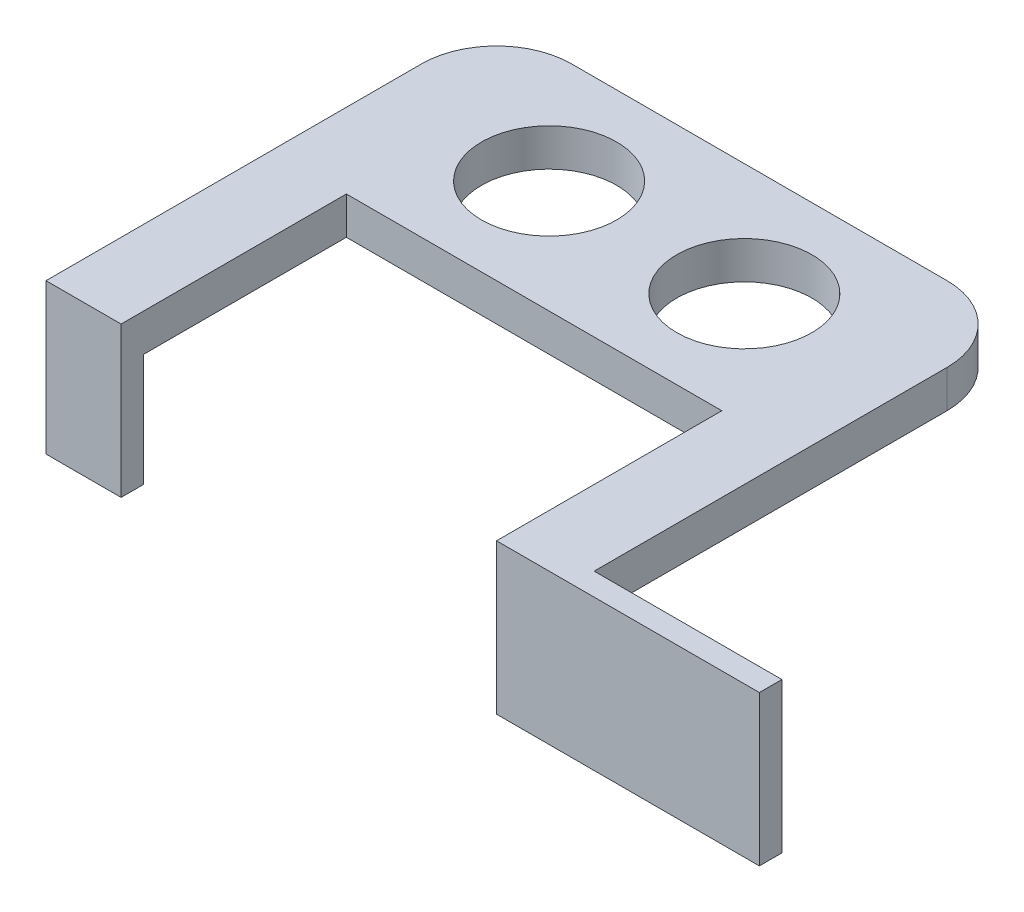
ISO-10303-21;
HEADER;
FILE_DESCRIPTION(('STEP AP214'),'2;1');
FILE_NAME('part.step','',(''),(''),'','','');
FILE_SCHEMA(('AUTOMOTIVE_DESIGN { 1 0 10303 214 1 1 1 1 }'));
ENDSEC;
DATA;
#1=APPLICATION_CONTEXT('core data for automotive mechanical design processes');
#2=APPLICATION_PROTOCOL_DEFINITION('international standard','automotive_design',2000,#1);
#3=PRODUCT_CONTEXT('',#1,'mechanical');
#4=PRODUCT('Part','Part','',(#3));
#5=PRODUCT_RELATED_PRODUCT_CATEGORY('part','',(#4));
#6=PRODUCT_DEFINITION_FORMATION('','',#4);
#7=PRODUCT_DEFINITION_CONTEXT('part definition',#1,'design');
#8=PRODUCT_DEFINITION('design','',#6,#7);
#9=PRODUCT_DEFINITION_SHAPE('','',#8);
#10=(LENGTH_UNIT() NAMED_UNIT(*) SI_UNIT(.MILLI.,.METRE.));
#11=(NAMED_UNIT(*) PLANE_ANGLE_UNIT() SI_UNIT($,.RADIAN.));
#12=(NAMED_UNIT(*) SI_UNIT($,.STERADIAN.) SOLID_ANGLE_UNIT());
#13=UNCERTAINTY_MEASURE_WITH_UNIT(LENGTH_MEASURE(1.E-05),#10,'distance_accuracy_value','');
#14=(GEOMETRIC_REPRESENTATION_CONTEXT(3) GLOBAL_UNCERTAINTY_ASSIGNED_CONTEXT((#13)) GLOBAL_UNIT_ASSIGNED_CONTEXT((#10,
#11,#12)) REPRESENTATION_CONTEXT('',''));
#15=CARTESIAN_POINT('',(0.,0.,0.));
#16=DIRECTION('',(0.,0.,1.));
#17=DIRECTION('',(1.,0.,0.));
#18=AXIS2_PLACEMENT_3D('',#15,#16,#17);
#19=CARTESIAN_POINT('',(-32.0499203875221,5.,-31.7049180327869));
#20=DIRECTION('',(0.,-1.,0.));
#21=DIRECTION('',(0.,0.,-1.));
#22=AXIS2_PLACEMENT_3D('',#19,#20,#21);
#23=PLANE('',#22);
#24=DIRECTION('',(0.,0.,1.));
#25=VECTOR('',#24,1.);
#26=CARTESIAN_POINT('',(17.9500796124779,5.,18.2950819672131));
#27=LINE('',#26,#25);
#28=CARTESIAN_POINT('',(17.9500796124779,5.,-11.7049180327869));
#29=VERTEX_POINT('',#28);
#30=CARTESIAN_POINT('',(17.9500796124779,5.,18.2950819672131));
#31=VERTEX_POINT('',#30);
#32=EDGE_CURVE('E259',#29,#31,#27,.T.);
#33=ORIENTED_EDGE('',*,*,#32,.T.);
#34=DIRECTION('',(1.,0.,0.));
#35=VECTOR('',#34,1.);
#36=CARTESIAN_POINT('',(52.9500796124779,5.,18.2950819672131));
#37=LINE('',#36,#35);
#38=CARTESIAN_POINT('',(52.9500796124779,5.,18.2950819672131));
#39=VERTEX_POINT('',#38);
#40=EDGE_CURVE('E261',#31,#39,#37,.T.);
#41=ORIENTED_EDGE('',*,*,#40,.T.);
#42=DIRECTION('',(0.,0.,-1.));
#43=VECTOR('',#42,1.);
#44=CARTESIAN_POINT('',(52.9500796124779,5.,15.2950819672131));
#45=LINE('',#44,#43);
#46=CARTESIAN_POINT('',(52.9500796124779,5.,15.2950819672131));
#47=VERTEX_POINT('',#46);
#48=EDGE_CURVE('E263',#39,#47,#45,.T.);
#49=ORIENTED_EDGE('',*,*,#48,.T.);
#50=DIRECTION('',(-1.,0.,0.));
#51=VECTOR('',#50,1.);
#52=CARTESIAN_POINT('',(27.9500796124779,5.,15.2950819672131));
#53=LINE('',#52,#51);
#54=CARTESIAN_POINT('',(27.9500796124779,5.,15.2950819672131));
#55=VERTEX_POINT('',#54);
#56=EDGE_CURVE('E265',#47,#55,#53,.T.);
#57=ORIENTED_EDGE('',*,*,#56,.T.);
#58=DIRECTION('',(0.,0.,-1.));
#59=VECTOR('',#58,1.);
#60=CARTESIAN_POINT('',(27.9500796124779,5.,-31.7049180327868));
#61=LINE('',#60,#59);
#62=CARTESIAN_POINT('',(27.9500796124779,5.,-31.7049180327868));
#63=VERTEX_POINT('',#62);
#64=EDGE_CURVE('E267',#55,#63,#61,.T.);
#65=ORIENTED_EDGE('',*,*,#64,.T.);
#66=CARTESIAN_POINT('',(17.9500796124779,5.,-31.7049180327869));
#67=DIRECTION('',(0.,1.,0.));
#68=DIRECTION('',(0.,0.,-1.));
#69=AXIS2_PLACEMENT_3D('',#66,#67,#68);
#70=CIRCLE('',#69,10.);
#71=CARTESIAN_POINT('',(17.9500796124778,5.,-41.7049180327869));
#72=VERTEX_POINT('',#71);
#73=EDGE_CURVE('E127',#63,#72,#70,.T.);
#74=ORIENTED_EDGE('',*,*,#73,.T.);
#75=DIRECTION('',(-1.,0.,0.));
#76=VECTOR('',#75,1.);
#77=CARTESIAN_POINT('',(-32.0499203875221,5.,-41.7049180327869));
#78=LINE('',#77,#76);
#79=CARTESIAN_POINT('',(-32.0499203875221,5.,-41.7049180327869));
#80=VERTEX_POINT('',#79);
#81=EDGE_CURVE('E122',#72,#80,#78,.T.);
#82=ORIENTED_EDGE('',*,*,#81,.T.);
#83=CARTESIAN_POINT('',(-32.0499203875221,5.,-31.7049180327869));
#84=DIRECTION('',(0.,1.,0.));
#85=DIRECTION('',(0.,0.,-1.));
#86=AXIS2_PLACEMENT_3D('',#83,#84,#85);
#87=CIRCLE('',#86,10.);
#88=CARTESIAN_POINT('',(-42.0499203875221,5.,-31.7049180327868));
#89=VERTEX_POINT('',#88);
#90=EDGE_CURVE('E125',#80,#89,#87,.T.);
#91=ORIENTED_EDGE('',*,*,#90,.T.);
#92=DIRECTION('',(0.,0.,1.));
#93=VECTOR('',#92,1.);
#94=CARTESIAN_POINT('',(-42.0499203875221,5.,18.2950819672131));
#95=LINE('',#94,#93);
#96=CARTESIAN_POINT('',(-42.0499203875221,5.,18.2950819672131));
#97=VERTEX_POINT('',#96);
#98=EDGE_CURVE('E56',#89,#97,#95,.T.);
#99=ORIENTED_EDGE('',*,*,#98,.T.);
#100=DIRECTION('',(1.,0.,0.));
#101=VECTOR('',#100,1.);
#102=CARTESIAN_POINT('',(-32.0499203875221,5.,18.2950819672131));
#103=LINE('',#102,#101);
#104=CARTESIAN_POINT('',(-32.0499203875221,5.,18.2950819672131));
#105=VERTEX_POINT('',#104);
#106=EDGE_CURVE('E158',#97,#105,#103,.T.);
#107=ORIENTED_EDGE('',*,*,#106,.T.);
#108=DIRECTION('',(0.,0.,-1.));
#109=VECTOR('',#108,1.);
#110=CARTESIAN_POINT('',(-32.0499203875221,5.,-11.7049180327869));
#111=LINE('',#110,#109);
#112=CARTESIAN_POINT('',(-32.0499203875221,5.,-11.7049180327869));
#113=VERTEX_POINT('',#112);
#114=EDGE_CURVE('E95',#105,#113,#111,.T.);
#115=ORIENTED_EDGE('',*,*,#114,.T.);
#116=DIRECTION('',(1.,0.,0.));
#117=VECTOR('',#116,1.);
#118=CARTESIAN_POINT('',(17.9500796124779,5.,-11.7049180327869));
#119=LINE('',#118,#117);
#120=EDGE_CURVE('E186',#113,#29,#119,.T.);
#121=ORIENTED_EDGE('',*,*,#120,.T.);
#122=EDGE_LOOP('',(#33,#41,#49,#57,#65,#74,#82,#91,#99,#107,#115,#121));
#123=FACE_BOUND('',#122,.T.);
#124=CARTESIAN_POINT('',(-20.0499203875221,5.,-26.7049180327869));
#125=DIRECTION('',(0.,1.,0.));
#126=DIRECTION('',(0.,0.,1.));
#127=AXIS2_PLACEMENT_3D('',#124,#125,#126);
#128=CIRCLE('',#127,9.);
#129=CARTESIAN_POINT('',(-20.0499203875221,5.,-17.7049180327869));
#130=VERTEX_POINT('',#129);
#131=EDGE_CURVE('E144',#130,#130,#128,.T.);
#132=ORIENTED_EDGE('',*,*,#131,.F.);
#133=EDGE_LOOP('',(#132));
#134=FACE_BOUND('',#133,.T.);
#135=CARTESIAN_POINT('',(5.95007961247786,5.,-26.7049180327869));
#136=DIRECTION('',(0.,1.,0.));
#137=DIRECTION('',(0.,0.,1.));
#138=AXIS2_PLACEMENT_3D('',#135,#136,#137);
#139=CIRCLE('',#138,9.);
#140=CARTESIAN_POINT('',(5.95007961247786,5.,-17.7049180327869));
#141=VERTEX_POINT('',#140);
#142=EDGE_CURVE('E453',#141,#141,#139,.T.);
#143=ORIENTED_EDGE('',*,*,#142,.F.);
#144=EDGE_LOOP('',(#143));
#145=FACE_BOUND('',#144,.T.);
#146=ADVANCED_FACE('F39',(#123,#134,#145),#23,.F.);
#147=CARTESIAN_POINT('',(-32.0499203875221,0.,-31.7049180327869));
#148=DIRECTION('',(0.,-1.,0.));
#149=DIRECTION('',(0.,0.,-1.));
#150=AXIS2_PLACEMENT_3D('',#147,#148,#149);
#151=PLANE('',#150);
#152=DIRECTION('',(1.,0.,0.));
#153=VECTOR('',#152,1.);
#154=CARTESIAN_POINT('',(-32.0499203875221,0.,15.2950819672131));
#155=LINE('',#154,#153);
#156=CARTESIAN_POINT('',(17.9500796124779,0.,15.2950819672131));
#157=VERTEX_POINT('',#156);
#158=CARTESIAN_POINT('',(27.9500796124779,0.,15.2950819672131));
#159=VERTEX_POINT('',#158);
#160=EDGE_CURVE('E198',#157,#159,#155,.T.);
#161=ORIENTED_EDGE('',*,*,#160,.F.);
#162=DIRECTION('',(0.,0.,1.));
#163=VECTOR('',#162,1.);
#164=CARTESIAN_POINT('',(17.9500796124779,0.,18.2950819672131));
#165=LINE('',#164,#163);
#166=CARTESIAN_POINT('',(17.9500796124779,0.,-11.7049180327869));
#167=VERTEX_POINT('',#166);
#168=EDGE_CURVE('E146',#167,#157,#165,.T.);
#169=ORIENTED_EDGE('',*,*,#168,.F.);
#170=DIRECTION('',(1.,0.,0.));
#171=VECTOR('',#170,1.);
#172=CARTESIAN_POINT('',(17.9500796124779,0.,-11.7049180327869));
#173=LINE('',#172,#171);
#174=CARTESIAN_POINT('',(-32.0499203875221,0.,-11.7049180327869));
#175=VERTEX_POINT('',#174);
#176=EDGE_CURVE('E143',#175,#167,#173,.T.);
#177=ORIENTED_EDGE('',*,*,#176,.F.);
#178=DIRECTION('',(0.,0.,-1.));
#179=VECTOR('',#178,1.);
#180=CARTESIAN_POINT('',(-32.0499203875221,0.,-11.7049180327869));
#181=LINE('',#180,#179);
#182=CARTESIAN_POINT('',(-32.0499203875221,0.,15.2950819672131));
#183=VERTEX_POINT('',#182);
#184=EDGE_CURVE('E141',#183,#175,#181,.T.);
#185=ORIENTED_EDGE('',*,*,#184,.F.);
#186=DIRECTION('',(1.,0.,0.));
#187=VECTOR('',#186,1.);
#188=CARTESIAN_POINT('',(-32.0499203875221,0.,15.2950819672131));
#189=LINE('',#188,#187);
#190=CARTESIAN_POINT('',(-42.0499203875221,0.,15.2950819672131));
#191=VERTEX_POINT('',#190);
#192=EDGE_CURVE('E230',#191,#183,#189,.T.);
#193=ORIENTED_EDGE('',*,*,#192,.F.);
#194=DIRECTION('',(0.,0.,1.));
#195=VECTOR('',#194,1.);
#196=CARTESIAN_POINT('',(-42.0499203875221,0.,18.2950819672131));
#197=LINE('',#196,#195);
#198=CARTESIAN_POINT('',(-42.0499203875221,0.,-31.7049180327868));
#199=VERTEX_POINT('',#198);
#200=EDGE_CURVE('E155',#199,#191,#197,.T.);
#201=ORIENTED_EDGE('',*,*,#200,.F.);
#202=CARTESIAN_POINT('',(-32.0499203875221,0.,-31.7049180327869));
#203=DIRECTION('',(0.,1.,0.));
#204=DIRECTION('',(0.,0.,-1.));
#205=AXIS2_PLACEMENT_3D('',#202,#203,#204);
#206=CIRCLE('',#205,10.);
#207=CARTESIAN_POINT('',(-32.0499203875221,0.,-41.7049180327869));
#208=VERTEX_POINT('',#207);
#209=EDGE_CURVE('E87',#208,#199,#206,.T.);
#210=ORIENTED_EDGE('',*,*,#209,.F.);
#211=DIRECTION('',(-1.,0.,0.));
#212=VECTOR('',#211,1.);
#213=CARTESIAN_POINT('',(-32.0499203875221,0.,-41.7049180327869));
#214=LINE('',#213,#212);
#215=CARTESIAN_POINT('',(17.9500796124778,0.,-41.7049180327869));
#216=VERTEX_POINT('',#215);
#217=EDGE_CURVE('E80',#216,#208,#214,.T.);
#218=ORIENTED_EDGE('',*,*,#217,.F.);
#219=CARTESIAN_POINT('',(17.9500796124779,0.,-31.7049180327869));
#220=DIRECTION('',(0.,1.,0.));
#221=DIRECTION('',(0.,0.,-1.));
#222=AXIS2_PLACEMENT_3D('',#219,#220,#221);
#223=CIRCLE('',#222,10.);
#224=CARTESIAN_POINT('',(27.9500796124779,0.,-31.7049180327868));
#225=VERTEX_POINT('',#224);
#226=EDGE_CURVE('E151',#225,#216,#223,.T.);
#227=ORIENTED_EDGE('',*,*,#226,.F.);
#228=DIRECTION('',(0.,0.,-1.));
#229=VECTOR('',#228,1.);
#230=CARTESIAN_POINT('',(27.9500796124779,0.,-31.7049180327868));
#231=LINE('',#230,#229);
#232=EDGE_CURVE('E149',#159,#225,#231,.T.);
#233=ORIENTED_EDGE('',*,*,#232,.F.);
#234=EDGE_LOOP('',(#161,#169,#177,#185,#193,#201,#210,#218,#227,#233));
#235=FACE_BOUND('',#234,.T.);
#236=CARTESIAN_POINT('',(-20.0499203875221,0.,-26.7049180327869));
#237=DIRECTION('',(0.,1.,0.));
#238=DIRECTION('',(0.,0.,1.));
#239=AXIS2_PLACEMENT_3D('',#236,#237,#238);
#240=CIRCLE('',#239,9.);
#241=CARTESIAN_POINT('',(-20.0499203875221,0.,-17.7049180327869));
#242=VERTEX_POINT('',#241);
#243=EDGE_CURVE('E255',#242,#242,#240,.T.);
#244=ORIENTED_EDGE('',*,*,#243,.T.);
#245=EDGE_LOOP('',(#244));
#246=FACE_BOUND('',#245,.T.);
#247=CARTESIAN_POINT('',(5.95007961247786,0.,-26.7049180327869));
#248=DIRECTION('',(0.,1.,0.));
#249=DIRECTION('',(0.,0.,1.));
#250=AXIS2_PLACEMENT_3D('',#247,#248,#249);
#251=CIRCLE('',#250,9.);
#252=CARTESIAN_POINT('',(5.95007961247786,0.,-17.7049180327869));
#253=VERTEX_POINT('',#252);
#254=EDGE_CURVE('E243',#253,#253,#251,.T.);
#255=ORIENTED_EDGE('',*,*,#254,.T.);
#256=EDGE_LOOP('',(#255));
#257=FACE_BOUND('',#256,.T.);
#258=ADVANCED_FACE('F191',(#235,#246,#257),#151,.T.);
#259=CARTESIAN_POINT('',(-32.0499203875221,5.,18.2950819672131));
#260=DIRECTION('',(0.,0.,-1.));
#261=DIRECTION('',(-1.,0.,0.));
#262=AXIS2_PLACEMENT_3D('',#259,#260,#261);
#263=PLANE('',#262);
#264=DIRECTION('',(0.,-1.,0.));
#265=VECTOR('',#264,1.);
#266=CARTESIAN_POINT('',(-42.0499203875221,5.,18.2950819672131));
#267=LINE('',#266,#265);
#268=CARTESIAN_POINT('',(-42.0499203875221,-15.,18.2950819672131));
#269=VERTEX_POINT('',#268);
#270=EDGE_CURVE('E137',#97,#269,#267,.T.);
#271=ORIENTED_EDGE('',*,*,#270,.T.);
#272=DIRECTION('',(1.,0.,0.));
#273=VECTOR('',#272,1.);
#274=CARTESIAN_POINT('',(-42.0499203875221,-15.,18.2950819672131));
#275=LINE('',#274,#273);
#276=CARTESIAN_POINT('',(-32.0499203875221,-15.,18.2950819672131));
#277=VERTEX_POINT('',#276);
#278=EDGE_CURVE('E446',#269,#277,#275,.T.);
#279=ORIENTED_EDGE('',*,*,#278,.T.);
#280=DIRECTION('',(0.,-1.,0.));
#281=VECTOR('',#280,1.);
#282=CARTESIAN_POINT('',(-32.0499203875221,5.,18.2950819672131));
#283=LINE('',#282,#281);
#284=EDGE_CURVE('E11',#105,#277,#283,.T.);
#285=ORIENTED_EDGE('',*,*,#284,.F.);
#286=ORIENTED_EDGE('',*,*,#106,.F.);
#287=EDGE_LOOP('',(#271,#279,#285,#286));
#288=FACE_BOUND('',#287,.T.);
#289=ADVANCED_FACE('F41',(#288),#263,.F.);
#290=CARTESIAN_POINT('',(-32.0499203875221,5.,-11.7049180327869));
#291=DIRECTION('',(-1.,0.,0.));
#292=DIRECTION('',(0.,0.,1.));
#293=AXIS2_PLACEMENT_3D('',#290,#291,#292);
#294=PLANE('',#293);
#295=DIRECTION('',(0.,-1.,0.));
#296=VECTOR('',#295,1.);
#297=CARTESIAN_POINT('',(-32.0499203875221,5.,-11.7049180327869));
#298=LINE('',#297,#296);
#299=EDGE_CURVE('E48',#113,#175,#298,.T.);
#300=ORIENTED_EDGE('',*,*,#299,.F.);
#301=ORIENTED_EDGE('',*,*,#114,.F.);
#302=ORIENTED_EDGE('',*,*,#284,.T.);
#303=DIRECTION('',(0.,0.,-1.));
#304=VECTOR('',#303,1.);
#305=CARTESIAN_POINT('',(-32.0499203875221,-15.,18.2950819672131));
#306=LINE('',#305,#304);
#307=CARTESIAN_POINT('',(-32.0499203875221,-15.,15.2950819672131));
#308=VERTEX_POINT('',#307);
#309=EDGE_CURVE('E448',#277,#308,#306,.T.);
#310=ORIENTED_EDGE('',*,*,#309,.T.);
#311=DIRECTION('',(0.,1.,0.));
#312=VECTOR('',#311,1.);
#313=CARTESIAN_POINT('',(-32.0499203875221,-15.,15.2950819672131));
#314=LINE('',#313,#312);
#315=EDGE_CURVE('E240',#308,#183,#314,.T.);
#316=ORIENTED_EDGE('',*,*,#315,.T.);
#317=ORIENTED_EDGE('',*,*,#184,.T.);
#318=EDGE_LOOP('',(#300,#301,#302,#310,#316,#317));
#319=FACE_BOUND('',#318,.T.);
#320=ADVANCED_FACE('F331',(#319),#294,.F.);
#321=CARTESIAN_POINT('',(17.9500796124779,5.,-11.7049180327869));
#322=DIRECTION('',(0.,0.,-1.));
#323=DIRECTION('',(-1.,0.,0.));
#324=AXIS2_PLACEMENT_3D('',#321,#322,#323);
#325=PLANE('',#324);
#326=ORIENTED_EDGE('',*,*,#176,.T.);
#327=DIRECTION('',(0.,-1.,0.));
#328=VECTOR('',#327,1.);
#329=CARTESIAN_POINT('',(17.9500796124779,5.,-11.7049180327869));
#330=LINE('',#329,#328);
#331=EDGE_CURVE('E178',#29,#167,#330,.T.);
#332=ORIENTED_EDGE('',*,*,#331,.F.);
#333=ORIENTED_EDGE('',*,*,#120,.F.);
#334=ORIENTED_EDGE('',*,*,#299,.T.);
#335=EDGE_LOOP('',(#326,#332,#333,#334));
#336=FACE_BOUND('',#335,.T.);
#337=ADVANCED_FACE('F184',(#336),#325,.F.);
#338=CARTESIAN_POINT('',(17.9500796124779,5.,18.2950819672131));
#339=DIRECTION('',(1.,0.,0.));
#340=DIRECTION('',(0.,0.,-1.));
#341=AXIS2_PLACEMENT_3D('',#338,#339,#340);
#342=PLANE('',#341);
#343=ORIENTED_EDGE('',*,*,#168,.T.);
#344=DIRECTION('',(0.,1.,0.));
#345=VECTOR('',#344,1.);
#346=CARTESIAN_POINT('',(17.9500796124779,-15.,15.2950819672131));
#347=LINE('',#346,#345);
#348=CARTESIAN_POINT('',(17.9500796124779,-15.,15.2950819672131));
#349=VERTEX_POINT('',#348);
#350=EDGE_CURVE('E205',#349,#157,#347,.T.);
#351=ORIENTED_EDGE('',*,*,#350,.F.);
#352=DIRECTION('',(0.,0.,1.));
#353=VECTOR('',#352,1.);
#354=CARTESIAN_POINT('',(17.9500796124779,-15.,18.2950819672131));
#355=LINE('',#354,#353);
#356=CARTESIAN_POINT('',(17.9500796124779,-15.,18.2950819672131));
#357=VERTEX_POINT('',#356);
#358=EDGE_CURVE('E427',#349,#357,#355,.T.);
#359=ORIENTED_EDGE('',*,*,#358,.T.);
#360=DIRECTION('',(0.,-1.,0.));
#361=VECTOR('',#360,1.);
#362=CARTESIAN_POINT('',(17.9500796124779,5.,18.2950819672131));
#363=LINE('',#362,#361);
#364=EDGE_CURVE('E175',#31,#357,#363,.T.);
#365=ORIENTED_EDGE('',*,*,#364,.F.);
#366=ORIENTED_EDGE('',*,*,#32,.F.);
#367=ORIENTED_EDGE('',*,*,#331,.T.);
#368=EDGE_LOOP('',(#343,#351,#359,#365,#366,#367));
#369=FACE_BOUND('',#368,.T.);
#370=ADVANCED_FACE('F201',(#369),#342,.F.);
#371=CARTESIAN_POINT('',(52.9500796124779,5.,18.2950819672131));
#372=DIRECTION('',(0.,0.,-1.));
#373=DIRECTION('',(-1.,0.,0.));
#374=AXIS2_PLACEMENT_3D('',#371,#372,#373);
#375=PLANE('',#374);
#376=ORIENTED_EDGE('',*,*,#364,.T.);
#377=DIRECTION('',(1.,0.,0.));
#378=VECTOR('',#377,1.);
#379=CARTESIAN_POINT('',(17.9500796124779,-15.,18.2950819672131));
#380=LINE('',#379,#378);
#381=CARTESIAN_POINT('',(52.9500796124779,-15.,18.2950819672131));
#382=VERTEX_POINT('',#381);
#383=EDGE_CURVE('E432',#357,#382,#380,.T.);
#384=ORIENTED_EDGE('',*,*,#383,.T.);
#385=DIRECTION('',(0.,-1.,0.));
#386=VECTOR('',#385,1.);
#387=CARTESIAN_POINT('',(52.9500796124779,5.,18.2950819672131));
#388=LINE('',#387,#386);
#389=EDGE_CURVE('E172',#39,#382,#388,.T.);
#390=ORIENTED_EDGE('',*,*,#389,.F.);
#391=ORIENTED_EDGE('',*,*,#40,.F.);
#392=EDGE_LOOP('',(#376,#384,#390,#391));
#393=FACE_BOUND('',#392,.T.);
#394=ADVANCED_FACE('F352',(#393),#375,.F.);
#395=CARTESIAN_POINT('',(52.9500796124779,5.,15.2950819672131));
#396=DIRECTION('',(-1.,0.,0.));
#397=DIRECTION('',(0.,0.,1.));
#398=AXIS2_PLACEMENT_3D('',#395,#396,#397);
#399=PLANE('',#398);
#400=ORIENTED_EDGE('',*,*,#389,.T.);
#401=DIRECTION('',(0.,0.,-1.));
#402=VECTOR('',#401,1.);
#403=CARTESIAN_POINT('',(52.9500796124779,-15.,18.2950819672131));
#404=LINE('',#403,#402);
#405=CARTESIAN_POINT('',(52.9500796124779,-15.,15.2950819672131));
#406=VERTEX_POINT('',#405);
#407=EDGE_CURVE('E438',#382,#406,#404,.T.);
#408=ORIENTED_EDGE('',*,*,#407,.T.);
#409=DIRECTION('',(0.,-1.,0.));
#410=VECTOR('',#409,1.);
#411=CARTESIAN_POINT('',(52.9500796124779,5.,15.2950819672131));
#412=LINE('',#411,#410);
#413=EDGE_CURVE('E169',#47,#406,#412,.T.);
#414=ORIENTED_EDGE('',*,*,#413,.F.);
#415=ORIENTED_EDGE('',*,*,#48,.F.);
#416=EDGE_LOOP('',(#400,#408,#414,#415));
#417=FACE_BOUND('',#416,.T.);
#418=ADVANCED_FACE('F363',(#417),#399,.F.);
#419=CARTESIAN_POINT('',(27.9500796124779,5.,15.2950819672131));
#420=DIRECTION('',(0.,0.,1.));
#421=DIRECTION('',(1.,0.,0.));
#422=AXIS2_PLACEMENT_3D('',#419,#420,#421);
#423=PLANE('',#422);
#424=ORIENTED_EDGE('',*,*,#413,.T.);
#425=DIRECTION('',(-1.,0.,0.));
#426=VECTOR('',#425,1.);
#427=CARTESIAN_POINT('',(17.9500796124779,-15.,15.2950819672131));
#428=LINE('',#427,#426);
#429=EDGE_CURVE('E430',#406,#349,#428,.T.);
#430=ORIENTED_EDGE('',*,*,#429,.T.);
#431=ORIENTED_EDGE('',*,*,#350,.T.);
#432=ORIENTED_EDGE('',*,*,#160,.T.);
#433=DIRECTION('',(0.,-1.,0.));
#434=VECTOR('',#433,1.);
#435=CARTESIAN_POINT('',(27.9500796124779,5.,15.2950819672131));
#436=LINE('',#435,#434);
#437=EDGE_CURVE('E166',#55,#159,#436,.T.);
#438=ORIENTED_EDGE('',*,*,#437,.F.);
#439=ORIENTED_EDGE('',*,*,#56,.F.);
#440=EDGE_LOOP('',(#424,#430,#431,#432,#438,#439));
#441=FACE_BOUND('',#440,.T.);
#442=ADVANCED_FACE('F285',(#441),#423,.F.);
#443=CARTESIAN_POINT('',(27.9500796124779,5.,-31.7049180327868));
#444=DIRECTION('',(-1.,0.,0.));
#445=DIRECTION('',(0.,0.,1.));
#446=AXIS2_PLACEMENT_3D('',#443,#444,#445);
#447=PLANE('',#446);
#448=ORIENTED_EDGE('',*,*,#232,.T.);
#449=DIRECTION('',(0.,-1.,0.));
#450=VECTOR('',#449,1.);
#451=CARTESIAN_POINT('',(27.9500796124779,5.,-31.7049180327868));
#452=LINE('',#451,#450);
#453=EDGE_CURVE('E163',#63,#225,#452,.T.);
#454=ORIENTED_EDGE('',*,*,#453,.F.);
#455=ORIENTED_EDGE('',*,*,#64,.F.);
#456=ORIENTED_EDGE('',*,*,#437,.T.);
#457=EDGE_LOOP('',(#448,#454,#455,#456));
#458=FACE_BOUND('',#457,.T.);
#459=ADVANCED_FACE('F273',(#458),#447,.F.);
#460=CARTESIAN_POINT('',(17.9500796124779,5.,-31.7049180327869));
#461=DIRECTION('',(0.,-1.,0.));
#462=DIRECTION('',(0.,0.,-1.));
#463=AXIS2_PLACEMENT_3D('',#460,#461,#462);
#464=CYLINDRICAL_SURFACE('',#463,10.);
#465=ORIENTED_EDGE('',*,*,#226,.T.);
#466=DIRECTION('',(0.,-1.,0.));
#467=VECTOR('',#466,1.);
#468=CARTESIAN_POINT('',(17.9500796124778,5.,-41.7049180327869));
#469=LINE('',#468,#467);
#470=EDGE_CURVE('E132',#72,#216,#469,.T.);
#471=ORIENTED_EDGE('',*,*,#470,.F.);
#472=ORIENTED_EDGE('',*,*,#73,.F.);
#473=ORIENTED_EDGE('',*,*,#453,.T.);
#474=EDGE_LOOP('',(#465,#471,#472,#473));
#475=FACE_BOUND('',#474,.T.);
#476=ADVANCED_FACE('F276',(#475),#464,.T.);
#477=CARTESIAN_POINT('',(-32.0499203875221,5.,-41.7049180327869));
#478=DIRECTION('',(0.,0.,1.));
#479=DIRECTION('',(1.,0.,0.));
#480=AXIS2_PLACEMENT_3D('',#477,#478,#479);
#481=PLANE('',#480);
#482=ORIENTED_EDGE('',*,*,#217,.T.);
#483=DIRECTION('',(0.,-1.,0.));
#484=VECTOR('',#483,1.);
#485=CARTESIAN_POINT('',(-32.0499203875221,5.,-41.7049180327869));
#486=LINE('',#485,#484);
#487=EDGE_CURVE('E130',#80,#208,#486,.T.);
#488=ORIENTED_EDGE('',*,*,#487,.F.);
#489=ORIENTED_EDGE('',*,*,#81,.F.);
#490=ORIENTED_EDGE('',*,*,#470,.T.);
#491=EDGE_LOOP('',(#482,#488,#489,#490));
#492=FACE_BOUND('',#491,.T.);
#493=ADVANCED_FACE('F131',(#492),#481,.F.);
#494=CARTESIAN_POINT('',(-32.0499203875221,5.,-31.7049180327869));
#495=DIRECTION('',(0.,-1.,0.));
#496=DIRECTION('',(0.,0.,-1.));
#497=AXIS2_PLACEMENT_3D('',#494,#495,#496);
#498=CYLINDRICAL_SURFACE('',#497,10.);
#499=ORIENTED_EDGE('',*,*,#209,.T.);
#500=DIRECTION('',(0.,-1.,0.));
#501=VECTOR('',#500,1.);
#502=CARTESIAN_POINT('',(-42.0499203875221,5.,-31.7049180327868));
#503=LINE('',#502,#501);
#504=EDGE_CURVE('E133',#89,#199,#503,.T.);
#505=ORIENTED_EDGE('',*,*,#504,.F.);
#506=ORIENTED_EDGE('',*,*,#90,.F.);
#507=ORIENTED_EDGE('',*,*,#487,.T.);
#508=EDGE_LOOP('',(#499,#505,#506,#507));
#509=FACE_BOUND('',#508,.T.);
#510=ADVANCED_FACE('F135',(#509),#498,.T.);
#511=CARTESIAN_POINT('',(-42.0499203875221,5.,18.2950819672131));
#512=DIRECTION('',(1.,0.,0.));
#513=DIRECTION('',(0.,0.,-1.));
#514=AXIS2_PLACEMENT_3D('',#511,#512,#513);
#515=PLANE('',#514);
#516=ORIENTED_EDGE('',*,*,#200,.T.);
#517=DIRECTION('',(0.,1.,0.));
#518=VECTOR('',#517,1.);
#519=CARTESIAN_POINT('',(-42.0499203875221,-15.,15.2950819672131));
#520=LINE('',#519,#518);
#521=CARTESIAN_POINT('',(-42.0499203875221,-15.,15.2950819672131));
#522=VERTEX_POINT('',#521);
#523=EDGE_CURVE('E233',#522,#191,#520,.T.);
#524=ORIENTED_EDGE('',*,*,#523,.F.);
#525=DIRECTION('',(0.,0.,1.));
#526=VECTOR('',#525,1.);
#527=CARTESIAN_POINT('',(-42.0499203875221,-15.,18.2950819672131));
#528=LINE('',#527,#526);
#529=EDGE_CURVE('E247',#522,#269,#528,.T.);
#530=ORIENTED_EDGE('',*,*,#529,.T.);
#531=ORIENTED_EDGE('',*,*,#270,.F.);
#532=ORIENTED_EDGE('',*,*,#98,.F.);
#533=ORIENTED_EDGE('',*,*,#504,.T.);
#534=EDGE_LOOP('',(#516,#524,#530,#531,#532,#533));
#535=FACE_BOUND('',#534,.T.);
#536=ADVANCED_FACE('F245',(#535),#515,.F.);
#537=CARTESIAN_POINT('',(-20.0499203875221,5.,-26.7049180327869));
#538=DIRECTION('',(0.,-1.,0.));
#539=DIRECTION('',(0.,0.,-1.));
#540=AXIS2_PLACEMENT_3D('',#537,#538,#539);
#541=CYLINDRICAL_SURFACE('',#540,9.);
#542=ORIENTED_EDGE('',*,*,#131,.T.);
#543=EDGE_LOOP('',(#542));
#544=FACE_BOUND('',#543,.T.);
#545=ORIENTED_EDGE('',*,*,#243,.F.);
#546=EDGE_LOOP('',(#545));
#547=FACE_BOUND('',#546,.T.);
#548=ADVANCED_FACE('F295',(#544,#547),#541,.F.);
#549=CARTESIAN_POINT('',(5.95007961247786,5.,-26.7049180327869));
#550=DIRECTION('',(0.,-1.,0.));
#551=DIRECTION('',(0.,0.,-1.));
#552=AXIS2_PLACEMENT_3D('',#549,#550,#551);
#553=CYLINDRICAL_SURFACE('',#552,9.);
#554=ORIENTED_EDGE('',*,*,#142,.T.);
#555=EDGE_LOOP('',(#554));
#556=FACE_BOUND('',#555,.T.);
#557=ORIENTED_EDGE('',*,*,#254,.F.);
#558=EDGE_LOOP('',(#557));
#559=FACE_BOUND('',#558,.T.);
#560=ADVANCED_FACE('F312',(#556,#559),#553,.F.);
#561=CARTESIAN_POINT('',(-42.0499203875221,-15.,15.2950819672131));
#562=DIRECTION('',(0.,0.,-1.));
#563=DIRECTION('',(-1.,0.,0.));
#564=AXIS2_PLACEMENT_3D('',#561,#562,#563);
#565=PLANE('',#564);
#566=ORIENTED_EDGE('',*,*,#523,.T.);
#567=ORIENTED_EDGE('',*,*,#192,.T.);
#568=ORIENTED_EDGE('',*,*,#315,.F.);
#569=DIRECTION('',(-1.,0.,0.));
#570=VECTOR('',#569,1.);
#571=CARTESIAN_POINT('',(-42.0499203875221,-15.,15.2950819672131));
#572=LINE('',#571,#570);
#573=EDGE_CURVE('E236',#308,#522,#572,.T.);
#574=ORIENTED_EDGE('',*,*,#573,.T.);
#575=EDGE_LOOP('',(#566,#567,#568,#574));
#576=FACE_BOUND('',#575,.T.);
#577=ADVANCED_FACE('F234',(#576),#565,.T.);
#578=CARTESIAN_POINT('',(0.,-15.,0.));
#579=DIRECTION('',(0.,-1.,0.));
#580=DIRECTION('',(0.,0.,-1.));
#581=AXIS2_PLACEMENT_3D('',#578,#579,#580);
#582=PLANE('',#581);
#583=ORIENTED_EDGE('',*,*,#529,.F.);
#584=ORIENTED_EDGE('',*,*,#573,.F.);
#585=ORIENTED_EDGE('',*,*,#309,.F.);
#586=ORIENTED_EDGE('',*,*,#278,.F.);
#587=EDGE_LOOP('',(#583,#584,#585,#586));
#588=FACE_BOUND('',#587,.T.);
#589=ADVANCED_FACE('F403',(#588),#582,.T.);
#590=CARTESIAN_POINT('',(0.,-15.,0.));
#591=DIRECTION('',(0.,-1.,0.));
#592=DIRECTION('',(0.,0.,-1.));
#593=AXIS2_PLACEMENT_3D('',#590,#591,#592);
#594=PLANE('',#593);
#595=ORIENTED_EDGE('',*,*,#358,.F.);
#596=ORIENTED_EDGE('',*,*,#429,.F.);
#597=ORIENTED_EDGE('',*,*,#407,.F.);
#598=ORIENTED_EDGE('',*,*,#383,.F.);
#599=EDGE_LOOP('',(#595,#596,#597,#598));
#600=FACE_BOUND('',#599,.T.);
#601=ADVANCED_FACE('F412',(#600),#594,.T.);
#602=CLOSED_SHELL('',(#146,#258,#289,#320,#337,#370,#394,#418,#442,#459,#476,#493,#510,#536,
#548,#560,#577,#589,#601));
#603=MANIFOLD_SOLID_BREP('B2',#602);
#604=ADVANCED_BREP_SHAPE_REPRESENTATION('',(#18,#603),#14);
#605=SHAPE_DEFINITION_REPRESENTATION(#9,#604);
ENDSEC;
END-ISO-10303-21;
